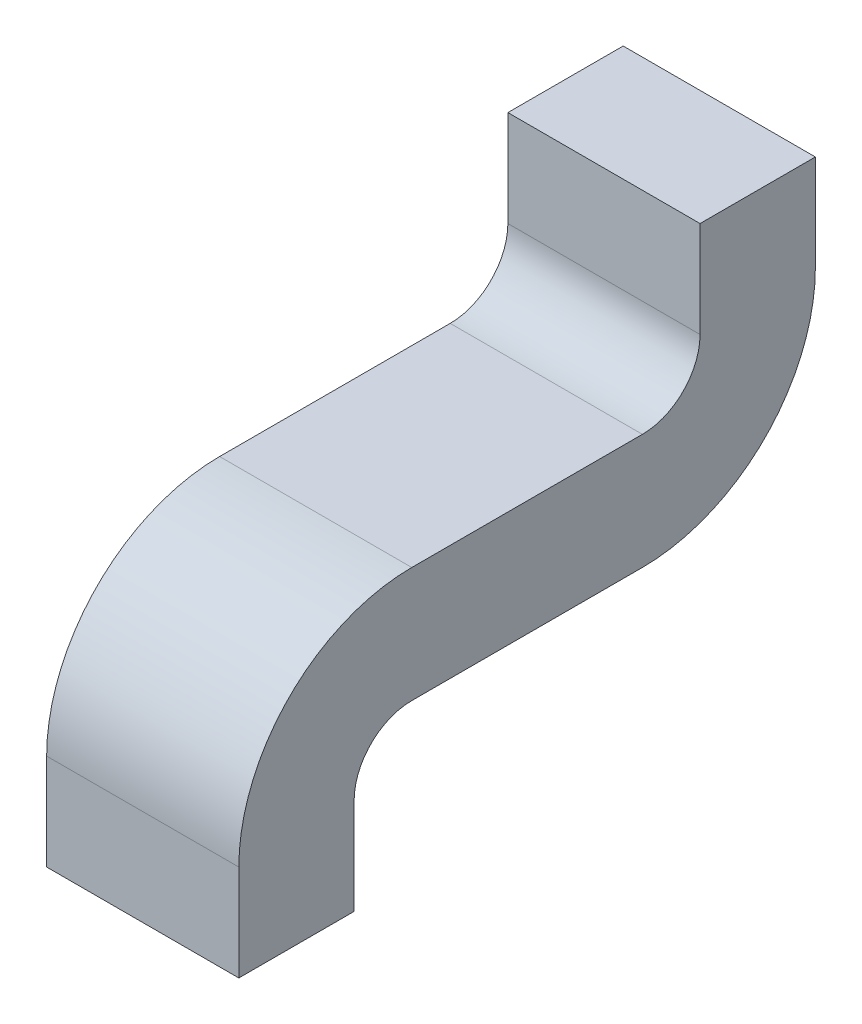
ISO-10303-21;
HEADER;
FILE_DESCRIPTION(('STEP AP214'),'2;1');
FILE_NAME('part.step','',(''),(''),'','','');
FILE_SCHEMA(('AUTOMOTIVE_DESIGN { 1 0 10303 214 1 1 1 1 }'));
ENDSEC;
DATA;
#1=APPLICATION_CONTEXT('core data for automotive mechanical design processes');
#2=APPLICATION_PROTOCOL_DEFINITION('international standard','automotive_design',2000,#1);
#3=PRODUCT_CONTEXT('',#1,'mechanical');
#4=PRODUCT('Part','Part','',(#3));
#5=PRODUCT_RELATED_PRODUCT_CATEGORY('part','',(#4));
#6=PRODUCT_DEFINITION_FORMATION('','',#4);
#7=PRODUCT_DEFINITION_CONTEXT('part definition',#1,'design');
#8=PRODUCT_DEFINITION('design','',#6,#7);
#9=PRODUCT_DEFINITION_SHAPE('','',#8);
#10=(LENGTH_UNIT() NAMED_UNIT(*) SI_UNIT(.MILLI.,.METRE.));
#11=(NAMED_UNIT(*) PLANE_ANGLE_UNIT() SI_UNIT($,.RADIAN.));
#12=(NAMED_UNIT(*) SI_UNIT($,.STERADIAN.) SOLID_ANGLE_UNIT());
#13=UNCERTAINTY_MEASURE_WITH_UNIT(LENGTH_MEASURE(1.E-05),#10,'distance_accuracy_value','');
#14=(GEOMETRIC_REPRESENTATION_CONTEXT(3) GLOBAL_UNCERTAINTY_ASSIGNED_CONTEXT((#13)) GLOBAL_UNIT_ASSIGNED_CONTEXT((#10,
#11,#12)) REPRESENTATION_CONTEXT('',''));
#15=CARTESIAN_POINT('',(0.,0.,0.));
#16=DIRECTION('',(0.,0.,1.));
#17=DIRECTION('',(1.,0.,0.));
#18=AXIS2_PLACEMENT_3D('',#15,#16,#17);
#19=CARTESIAN_POINT('',(-0.775,-0.925,-0.175));
#20=DIRECTION('',(-1.,0.,0.));
#21=DIRECTION('',(0.,0.,1.));
#22=AXIS2_PLACEMENT_3D('',#19,#20,#21);
#23=PLANE('',#22);
#24=CARTESIAN_POINT('',(-0.775,-0.925,-0.175));
#25=DIRECTION('',(1.,0.,0.));
#26=DIRECTION('',(0.,0.,-1.));
#27=AXIS2_PLACEMENT_3D('',#24,#25,#26);
#28=CIRCLE('',#27,0.0750000000000007);
#29=CARTESIAN_POINT('',(-0.775,-0.849999999999999,-0.175));
#30=VERTEX_POINT('',#29);
#31=CARTESIAN_POINT('',(-0.775,-0.925,-0.0999999999999998));
#32=VERTEX_POINT('',#31);
#33=EDGE_CURVE('E183',#30,#32,#28,.T.);
#34=ORIENTED_EDGE('',*,*,#33,.T.);
#35=DIRECTION('',(0.,1.,0.));
#36=VECTOR('',#35,1.);
#37=CARTESIAN_POINT('',(-0.775,-0.924999999999998,-0.0999999999999998));
#38=LINE('',#37,#36);
#39=CARTESIAN_POINT('',(-0.775,-1.05,-0.0999999999999998));
#40=VERTEX_POINT('',#39);
#41=EDGE_CURVE('E139',#32,#40,#38,.F.);
#42=ORIENTED_EDGE('',*,*,#41,.T.);
#43=DIRECTION('',(0.,0.,1.));
#44=VECTOR('',#43,1.);
#45=CARTESIAN_POINT('',(-0.775,-1.05,-0.0999999999999998));
#46=LINE('',#45,#44);
#47=CARTESIAN_POINT('',(-0.775,-1.05,0.0500000000000002));
#48=VERTEX_POINT('',#47);
#49=EDGE_CURVE('E129',#40,#48,#46,.T.);
#50=ORIENTED_EDGE('',*,*,#49,.T.);
#51=DIRECTION('',(0.,1.,0.));
#52=VECTOR('',#51,1.);
#53=CARTESIAN_POINT('',(-0.775,-1.05,0.0500000000000002));
#54=LINE('',#53,#52);
#55=CARTESIAN_POINT('',(-0.775,-0.925,0.0500000000000002));
#56=VERTEX_POINT('',#55);
#57=EDGE_CURVE('E117',#48,#56,#54,.T.);
#58=ORIENTED_EDGE('',*,*,#57,.T.);
#59=CARTESIAN_POINT('',(-0.775,-0.925,-0.175));
#60=DIRECTION('',(1.,0.,0.));
#61=DIRECTION('',(0.,0.,-1.));
#62=AXIS2_PLACEMENT_3D('',#59,#60,#61);
#63=CIRCLE('',#62,0.225);
#64=CARTESIAN_POINT('',(-0.775,-0.7,-0.175));
#65=VERTEX_POINT('',#64);
#66=EDGE_CURVE('E20',#65,#56,#63,.T.);
#67=ORIENTED_EDGE('',*,*,#66,.F.);
#68=DIRECTION('',(0.,0.,-1.));
#69=VECTOR('',#68,1.);
#70=CARTESIAN_POINT('',(-0.775,-0.7,-0.175));
#71=LINE('',#70,#69);
#72=CARTESIAN_POINT('',(-0.775,-0.7,-0.475));
#73=VERTEX_POINT('',#72);
#74=EDGE_CURVE('E102',#65,#73,#71,.T.);
#75=ORIENTED_EDGE('',*,*,#74,.T.);
#76=CARTESIAN_POINT('',(-0.775,-0.625,-0.475));
#77=DIRECTION('',(1.,0.,0.));
#78=DIRECTION('',(0.,0.,-1.));
#79=AXIS2_PLACEMENT_3D('',#76,#77,#78);
#80=CIRCLE('',#79,0.075);
#81=CARTESIAN_POINT('',(-0.775,-0.625,-0.55));
#82=VERTEX_POINT('',#81);
#83=EDGE_CURVE('E124',#73,#82,#80,.T.);
#84=ORIENTED_EDGE('',*,*,#83,.T.);
#85=DIRECTION('',(0.,1.,0.));
#86=VECTOR('',#85,1.);
#87=CARTESIAN_POINT('',(-0.775,-0.625,-0.55));
#88=LINE('',#87,#86);
#89=CARTESIAN_POINT('',(-0.775,-0.5,-0.55));
#90=VERTEX_POINT('',#89);
#91=EDGE_CURVE('E163',#82,#90,#88,.T.);
#92=ORIENTED_EDGE('',*,*,#91,.T.);
#93=DIRECTION('',(0.,0.,-1.));
#94=VECTOR('',#93,1.);
#95=CARTESIAN_POINT('',(-0.775,-0.5,-0.55));
#96=LINE('',#95,#94);
#97=CARTESIAN_POINT('',(-0.775,-0.5,-0.7));
#98=VERTEX_POINT('',#97);
#99=EDGE_CURVE('E157',#90,#98,#96,.T.);
#100=ORIENTED_EDGE('',*,*,#99,.T.);
#101=DIRECTION('',(0.,-1.,0.));
#102=VECTOR('',#101,1.);
#103=CARTESIAN_POINT('',(-0.775,-0.5,-0.7));
#104=LINE('',#103,#102);
#105=CARTESIAN_POINT('',(-0.775,-0.625,-0.699999999999999));
#106=VERTEX_POINT('',#105);
#107=EDGE_CURVE('E150',#98,#106,#104,.T.);
#108=ORIENTED_EDGE('',*,*,#107,.T.);
#109=CARTESIAN_POINT('',(-0.775,-0.625,-0.475));
#110=DIRECTION('',(1.,0.,0.));
#111=DIRECTION('',(0.,0.,-1.));
#112=AXIS2_PLACEMENT_3D('',#109,#110,#111);
#113=CIRCLE('',#112,0.224999999999999);
#114=CARTESIAN_POINT('',(-0.775,-0.849999999999998,-0.475));
#115=VERTEX_POINT('',#114);
#116=EDGE_CURVE('E185',#115,#106,#113,.T.);
#117=ORIENTED_EDGE('',*,*,#116,.F.);
#118=DIRECTION('',(0.,0.,1.));
#119=VECTOR('',#118,1.);
#120=CARTESIAN_POINT('',(-0.775,-0.849999999999998,-0.475));
#121=LINE('',#120,#119);
#122=EDGE_CURVE('E145',#115,#30,#121,.T.);
#123=ORIENTED_EDGE('',*,*,#122,.T.);
#124=EDGE_LOOP('',(#34,#42,#50,#58,#67,#75,#84,#92,#100,#108,#117,#123));
#125=FACE_BOUND('',#124,.T.);
#126=ADVANCED_FACE('F17',(#125),#23,.T.);
#127=CARTESIAN_POINT('',(-0.525,-0.925,-0.175));
#128=DIRECTION('',(1.,0.,0.));
#129=DIRECTION('',(0.,0.,-1.));
#130=AXIS2_PLACEMENT_3D('',#127,#128,#129);
#131=CYLINDRICAL_SURFACE('',#130,0.225);
#132=ORIENTED_EDGE('',*,*,#66,.T.);
#133=DIRECTION('',(1.,0.,0.));
#134=VECTOR('',#133,1.);
#135=CARTESIAN_POINT('',(-0.525,-0.925,0.0500000000000002));
#136=LINE('',#135,#134);
#137=CARTESIAN_POINT('',(-0.525,-0.925,0.0500000000000002));
#138=VERTEX_POINT('',#137);
#139=EDGE_CURVE('E136',#56,#138,#136,.T.);
#140=ORIENTED_EDGE('',*,*,#139,.T.);
#141=CARTESIAN_POINT('',(-0.525,-0.925,-0.175));
#142=DIRECTION('',(1.,0.,0.));
#143=DIRECTION('',(0.,0.,-1.));
#144=AXIS2_PLACEMENT_3D('',#141,#142,#143);
#145=CIRCLE('',#144,0.225);
#146=CARTESIAN_POINT('',(-0.525,-0.7,-0.175));
#147=VERTEX_POINT('',#146);
#148=EDGE_CURVE('E123',#138,#147,#145,.F.);
#149=ORIENTED_EDGE('',*,*,#148,.T.);
#150=DIRECTION('',(1.,0.,0.));
#151=VECTOR('',#150,1.);
#152=CARTESIAN_POINT('',(-0.525,-0.7,-0.175));
#153=LINE('',#152,#151);
#154=EDGE_CURVE('E107',#147,#65,#153,.F.);
#155=ORIENTED_EDGE('',*,*,#154,.T.);
#156=EDGE_LOOP('',(#132,#140,#149,#155));
#157=FACE_BOUND('',#156,.T.);
#158=ADVANCED_FACE('F122',(#157),#131,.T.);
#159=CARTESIAN_POINT('',(-0.525,-0.7,-0.175));
#160=DIRECTION('',(0.,-1.,0.));
#161=DIRECTION('',(0.,0.,-1.));
#162=AXIS2_PLACEMENT_3D('',#159,#160,#161);
#163=PLANE('',#162);
#164=DIRECTION('',(0.,0.,1.));
#165=VECTOR('',#164,1.);
#166=CARTESIAN_POINT('',(-0.525,-0.7,-0.175));
#167=LINE('',#166,#165);
#168=CARTESIAN_POINT('',(-0.525,-0.7,-0.475));
#169=VERTEX_POINT('',#168);
#170=EDGE_CURVE('E181',#147,#169,#167,.F.);
#171=ORIENTED_EDGE('',*,*,#170,.T.);
#172=DIRECTION('',(1.,0.,0.));
#173=VECTOR('',#172,1.);
#174=CARTESIAN_POINT('',(-0.525,-0.7,-0.475));
#175=LINE('',#174,#173);
#176=EDGE_CURVE('E109',#169,#73,#175,.F.);
#177=ORIENTED_EDGE('',*,*,#176,.T.);
#178=ORIENTED_EDGE('',*,*,#74,.F.);
#179=ORIENTED_EDGE('',*,*,#154,.F.);
#180=EDGE_LOOP('',(#171,#177,#178,#179));
#181=FACE_BOUND('',#180,.T.);
#182=ADVANCED_FACE('F105',(#181),#163,.F.);
#183=CARTESIAN_POINT('',(-0.525,-0.625,-0.475));
#184=DIRECTION('',(1.,0.,0.));
#185=DIRECTION('',(0.,0.,-1.));
#186=AXIS2_PLACEMENT_3D('',#183,#184,#185);
#187=CYLINDRICAL_SURFACE('',#186,0.075);
#188=CARTESIAN_POINT('',(-0.525,-0.625,-0.475));
#189=DIRECTION('',(1.,0.,0.));
#190=DIRECTION('',(0.,0.,-1.));
#191=AXIS2_PLACEMENT_3D('',#188,#189,#190);
#192=CIRCLE('',#191,0.075);
#193=CARTESIAN_POINT('',(-0.525,-0.625,-0.55));
#194=VERTEX_POINT('',#193);
#195=EDGE_CURVE('E177',#169,#194,#192,.T.);
#196=ORIENTED_EDGE('',*,*,#195,.T.);
#197=DIRECTION('',(1.,0.,0.));
#198=VECTOR('',#197,1.);
#199=CARTESIAN_POINT('',(-0.525,-0.625,-0.55));
#200=LINE('',#199,#198);
#201=EDGE_CURVE('E160',#194,#82,#200,.F.);
#202=ORIENTED_EDGE('',*,*,#201,.T.);
#203=ORIENTED_EDGE('',*,*,#83,.F.);
#204=ORIENTED_EDGE('',*,*,#176,.F.);
#205=EDGE_LOOP('',(#196,#202,#203,#204));
#206=FACE_BOUND('',#205,.T.);
#207=ADVANCED_FACE('F207',(#206),#187,.F.);
#208=CARTESIAN_POINT('',(-0.525,-0.625,-0.55));
#209=DIRECTION('',(0.,0.,-1.));
#210=DIRECTION('',(0.,1.,0.));
#211=AXIS2_PLACEMENT_3D('',#208,#209,#210);
#212=PLANE('',#211);
#213=DIRECTION('',(0.,1.,0.));
#214=VECTOR('',#213,1.);
#215=CARTESIAN_POINT('',(-0.525,-0.925,-0.55));
#216=LINE('',#215,#214);
#217=CARTESIAN_POINT('',(-0.525,-0.5,-0.55));
#218=VERTEX_POINT('',#217);
#219=EDGE_CURVE('E180',#194,#218,#216,.T.);
#220=ORIENTED_EDGE('',*,*,#219,.T.);
#221=DIRECTION('',(1.,0.,0.));
#222=VECTOR('',#221,1.);
#223=CARTESIAN_POINT('',(-0.525,-0.5,-0.55));
#224=LINE('',#223,#222);
#225=EDGE_CURVE('E154',#218,#90,#224,.F.);
#226=ORIENTED_EDGE('',*,*,#225,.T.);
#227=ORIENTED_EDGE('',*,*,#91,.F.);
#228=ORIENTED_EDGE('',*,*,#201,.F.);
#229=EDGE_LOOP('',(#220,#226,#227,#228));
#230=FACE_BOUND('',#229,.T.);
#231=ADVANCED_FACE('F212',(#230),#212,.F.);
#232=CARTESIAN_POINT('',(-0.525,-0.5,-0.55));
#233=DIRECTION('',(0.,-1.,0.));
#234=DIRECTION('',(0.,0.,-1.));
#235=AXIS2_PLACEMENT_3D('',#232,#233,#234);
#236=PLANE('',#235);
#237=DIRECTION('',(0.,0.,1.));
#238=VECTOR('',#237,1.);
#239=CARTESIAN_POINT('',(-0.525,-0.5,-0.175));
#240=LINE('',#239,#238);
#241=CARTESIAN_POINT('',(-0.525,-0.5,-0.7));
#242=VERTEX_POINT('',#241);
#243=EDGE_CURVE('E198',#218,#242,#240,.F.);
#244=ORIENTED_EDGE('',*,*,#243,.T.);
#245=DIRECTION('',(1.,0.,0.));
#246=VECTOR('',#245,1.);
#247=CARTESIAN_POINT('',(-0.525,-0.5,-0.7));
#248=LINE('',#247,#246);
#249=EDGE_CURVE('E153',#242,#98,#248,.F.);
#250=ORIENTED_EDGE('',*,*,#249,.T.);
#251=ORIENTED_EDGE('',*,*,#99,.F.);
#252=ORIENTED_EDGE('',*,*,#225,.F.);
#253=EDGE_LOOP('',(#244,#250,#251,#252));
#254=FACE_BOUND('',#253,.T.);
#255=ADVANCED_FACE('F257',(#254),#236,.F.);
#256=CARTESIAN_POINT('',(-0.525,-0.5,-0.7));
#257=DIRECTION('',(0.,0.,1.));
#258=DIRECTION('',(0.,-1.,0.));
#259=AXIS2_PLACEMENT_3D('',#256,#257,#258);
#260=PLANE('',#259);
#261=DIRECTION('',(0.,1.,0.));
#262=VECTOR('',#261,1.);
#263=CARTESIAN_POINT('',(-0.525,-0.925,-0.7));
#264=LINE('',#263,#262);
#265=CARTESIAN_POINT('',(-0.525,-0.625,-0.699999999999999));
#266=VERTEX_POINT('',#265);
#267=EDGE_CURVE('E176',#242,#266,#264,.F.);
#268=ORIENTED_EDGE('',*,*,#267,.T.);
#269=DIRECTION('',(1.,0.,0.));
#270=VECTOR('',#269,1.);
#271=CARTESIAN_POINT('',(-0.525,-0.625,-0.699999999999999));
#272=LINE('',#271,#270);
#273=EDGE_CURVE('E149',#106,#266,#272,.T.);
#274=ORIENTED_EDGE('',*,*,#273,.F.);
#275=ORIENTED_EDGE('',*,*,#107,.F.);
#276=ORIENTED_EDGE('',*,*,#249,.F.);
#277=EDGE_LOOP('',(#268,#274,#275,#276));
#278=FACE_BOUND('',#277,.T.);
#279=ADVANCED_FACE('F256',(#278),#260,.F.);
#280=CARTESIAN_POINT('',(-0.525,-0.625,-0.475));
#281=DIRECTION('',(1.,0.,0.));
#282=DIRECTION('',(0.,0.,-1.));
#283=AXIS2_PLACEMENT_3D('',#280,#281,#282);
#284=CYLINDRICAL_SURFACE('',#283,0.224999999999999);
#285=ORIENTED_EDGE('',*,*,#116,.T.);
#286=ORIENTED_EDGE('',*,*,#273,.T.);
#287=CARTESIAN_POINT('',(-0.525,-0.625,-0.475));
#288=DIRECTION('',(1.,0.,0.));
#289=DIRECTION('',(0.,0.,-1.));
#290=AXIS2_PLACEMENT_3D('',#287,#288,#289);
#291=CIRCLE('',#290,0.224999999999999);
#292=CARTESIAN_POINT('',(-0.525,-0.849999999999998,-0.475));
#293=VERTEX_POINT('',#292);
#294=EDGE_CURVE('E173',#266,#293,#291,.F.);
#295=ORIENTED_EDGE('',*,*,#294,.T.);
#296=DIRECTION('',(1.,0.,0.));
#297=VECTOR('',#296,1.);
#298=CARTESIAN_POINT('',(-0.525,-0.849999999999998,-0.475));
#299=LINE('',#298,#297);
#300=EDGE_CURVE('E148',#293,#115,#299,.F.);
#301=ORIENTED_EDGE('',*,*,#300,.T.);
#302=EDGE_LOOP('',(#285,#286,#295,#301));
#303=FACE_BOUND('',#302,.T.);
#304=ADVANCED_FACE('F241',(#303),#284,.T.);
#305=CARTESIAN_POINT('',(-0.525,-0.849999999999998,-0.475));
#306=DIRECTION('',(0.,1.,0.));
#307=DIRECTION('',(0.,0.,1.));
#308=AXIS2_PLACEMENT_3D('',#305,#306,#307);
#309=PLANE('',#308);
#310=DIRECTION('',(0.,0.,1.));
#311=VECTOR('',#310,1.);
#312=CARTESIAN_POINT('',(-0.525,-0.849999999999998,-0.175));
#313=LINE('',#312,#311);
#314=CARTESIAN_POINT('',(-0.525,-0.849999999999999,-0.175));
#315=VERTEX_POINT('',#314);
#316=EDGE_CURVE('E172',#293,#315,#313,.T.);
#317=ORIENTED_EDGE('',*,*,#316,.T.);
#318=DIRECTION('',(1.,0.,0.));
#319=VECTOR('',#318,1.);
#320=CARTESIAN_POINT('',(-0.525,-0.849999999999999,-0.175));
#321=LINE('',#320,#319);
#322=EDGE_CURVE('E142',#315,#30,#321,.F.);
#323=ORIENTED_EDGE('',*,*,#322,.T.);
#324=ORIENTED_EDGE('',*,*,#122,.F.);
#325=ORIENTED_EDGE('',*,*,#300,.F.);
#326=EDGE_LOOP('',(#317,#323,#324,#325));
#327=FACE_BOUND('',#326,.T.);
#328=ADVANCED_FACE('F246',(#327),#309,.F.);
#329=CARTESIAN_POINT('',(-0.525,-0.925,-0.175));
#330=DIRECTION('',(1.,0.,0.));
#331=DIRECTION('',(0.,0.,-1.));
#332=AXIS2_PLACEMENT_3D('',#329,#330,#331);
#333=CYLINDRICAL_SURFACE('',#332,0.0750000000000007);
#334=CARTESIAN_POINT('',(-0.525,-0.925,-0.175));
#335=DIRECTION('',(1.,0.,0.));
#336=DIRECTION('',(0.,0.,-1.));
#337=AXIS2_PLACEMENT_3D('',#334,#335,#336);
#338=CIRCLE('',#337,0.0750000000000007);
#339=CARTESIAN_POINT('',(-0.525,-0.925,-0.0999999999999998));
#340=VERTEX_POINT('',#339);
#341=EDGE_CURVE('E168',#315,#340,#338,.T.);
#342=ORIENTED_EDGE('',*,*,#341,.T.);
#343=DIRECTION('',(1.,0.,0.));
#344=VECTOR('',#343,1.);
#345=CARTESIAN_POINT('',(-0.525,-0.924999999999999,-0.0999999999999998));
#346=LINE('',#345,#344);
#347=EDGE_CURVE('E132',#340,#32,#346,.F.);
#348=ORIENTED_EDGE('',*,*,#347,.T.);
#349=ORIENTED_EDGE('',*,*,#33,.F.);
#350=ORIENTED_EDGE('',*,*,#322,.F.);
#351=EDGE_LOOP('',(#342,#348,#349,#350));
#352=FACE_BOUND('',#351,.T.);
#353=ADVANCED_FACE('F259',(#352),#333,.F.);
#354=CARTESIAN_POINT('',(-0.525,-0.924999999999998,-0.0999999999999998));
#355=DIRECTION('',(0.,0.,1.));
#356=DIRECTION('',(1.,0.,0.));
#357=AXIS2_PLACEMENT_3D('',#354,#355,#356);
#358=PLANE('',#357);
#359=DIRECTION('',(0.,1.,0.));
#360=VECTOR('',#359,1.);
#361=CARTESIAN_POINT('',(-0.525,-0.925,-0.0999999999999998));
#362=LINE('',#361,#360);
#363=CARTESIAN_POINT('',(-0.525,-1.05,-0.0999999999999998));
#364=VERTEX_POINT('',#363);
#365=EDGE_CURVE('E171',#340,#364,#362,.F.);
#366=ORIENTED_EDGE('',*,*,#365,.T.);
#367=DIRECTION('',(1.,0.,0.));
#368=VECTOR('',#367,1.);
#369=CARTESIAN_POINT('',(-0.525,-1.05,-0.0999999999999998));
#370=LINE('',#369,#368);
#371=EDGE_CURVE('E131',#364,#40,#370,.F.);
#372=ORIENTED_EDGE('',*,*,#371,.T.);
#373=ORIENTED_EDGE('',*,*,#41,.F.);
#374=ORIENTED_EDGE('',*,*,#347,.F.);
#375=EDGE_LOOP('',(#366,#372,#373,#374));
#376=FACE_BOUND('',#375,.T.);
#377=ADVANCED_FACE('F262',(#376),#358,.F.);
#378=CARTESIAN_POINT('',(-0.525,-1.05,-0.0999999999999998));
#379=DIRECTION('',(0.,1.,0.));
#380=DIRECTION('',(0.,0.,1.));
#381=AXIS2_PLACEMENT_3D('',#378,#379,#380);
#382=PLANE('',#381);
#383=DIRECTION('',(0.,0.,1.));
#384=VECTOR('',#383,1.);
#385=CARTESIAN_POINT('',(-0.525,-1.05,-0.175));
#386=LINE('',#385,#384);
#387=CARTESIAN_POINT('',(-0.525,-1.05,0.0500000000000002));
#388=VERTEX_POINT('',#387);
#389=EDGE_CURVE('E26',#364,#388,#386,.T.);
#390=ORIENTED_EDGE('',*,*,#389,.T.);
#391=DIRECTION('',(1.,0.,0.));
#392=VECTOR('',#391,1.);
#393=CARTESIAN_POINT('',(-0.525,-1.05,0.0500000000000002));
#394=LINE('',#393,#392);
#395=EDGE_CURVE('E34',#388,#48,#394,.F.);
#396=ORIENTED_EDGE('',*,*,#395,.T.);
#397=ORIENTED_EDGE('',*,*,#49,.F.);
#398=ORIENTED_EDGE('',*,*,#371,.F.);
#399=EDGE_LOOP('',(#390,#396,#397,#398));
#400=FACE_BOUND('',#399,.T.);
#401=ADVANCED_FACE('F266',(#400),#382,.F.);
#402=CARTESIAN_POINT('',(-0.525,-1.05,0.0500000000000002));
#403=DIRECTION('',(0.,0.,-1.));
#404=DIRECTION('',(0.,1.,0.));
#405=AXIS2_PLACEMENT_3D('',#402,#403,#404);
#406=PLANE('',#405);
#407=DIRECTION('',(0.,1.,0.));
#408=VECTOR('',#407,1.);
#409=CARTESIAN_POINT('',(-0.525,-0.925,0.0500000000000002));
#410=LINE('',#409,#408);
#411=EDGE_CURVE('E11',#388,#138,#410,.T.);
#412=ORIENTED_EDGE('',*,*,#411,.T.);
#413=ORIENTED_EDGE('',*,*,#139,.F.);
#414=ORIENTED_EDGE('',*,*,#57,.F.);
#415=ORIENTED_EDGE('',*,*,#395,.F.);
#416=EDGE_LOOP('',(#412,#413,#414,#415));
#417=FACE_BOUND('',#416,.T.);
#418=ADVANCED_FACE('F268',(#417),#406,.F.);
#419=CARTESIAN_POINT('',(-0.525,-0.925,-0.175));
#420=DIRECTION('',(-1.,0.,0.));
#421=DIRECTION('',(0.,0.,1.));
#422=AXIS2_PLACEMENT_3D('',#419,#420,#421);
#423=PLANE('',#422);
#424=ORIENTED_EDGE('',*,*,#389,.F.);
#425=ORIENTED_EDGE('',*,*,#365,.F.);
#426=ORIENTED_EDGE('',*,*,#341,.F.);
#427=ORIENTED_EDGE('',*,*,#316,.F.);
#428=ORIENTED_EDGE('',*,*,#294,.F.);
#429=ORIENTED_EDGE('',*,*,#267,.F.);
#430=ORIENTED_EDGE('',*,*,#243,.F.);
#431=ORIENTED_EDGE('',*,*,#219,.F.);
#432=ORIENTED_EDGE('',*,*,#195,.F.);
#433=ORIENTED_EDGE('',*,*,#170,.F.);
#434=ORIENTED_EDGE('',*,*,#148,.F.);
#435=ORIENTED_EDGE('',*,*,#411,.F.);
#436=EDGE_LOOP('',(#424,#425,#426,#427,#428,#429,#430,#431,#432,#433,#434,#435));
#437=FACE_BOUND('',#436,.T.);
#438=ADVANCED_FACE('F216',(#437),#423,.F.);
#439=CLOSED_SHELL('',(#126,#158,#182,#207,#231,#255,#279,#304,#328,#353,#377,#401,#418,#438));
#440=MANIFOLD_SOLID_BREP('B1',#439);
#441=ADVANCED_BREP_SHAPE_REPRESENTATION('',(#18,#440),#14);
#442=SHAPE_DEFINITION_REPRESENTATION(#9,#441);
ENDSEC;
END-ISO-10303-21;
